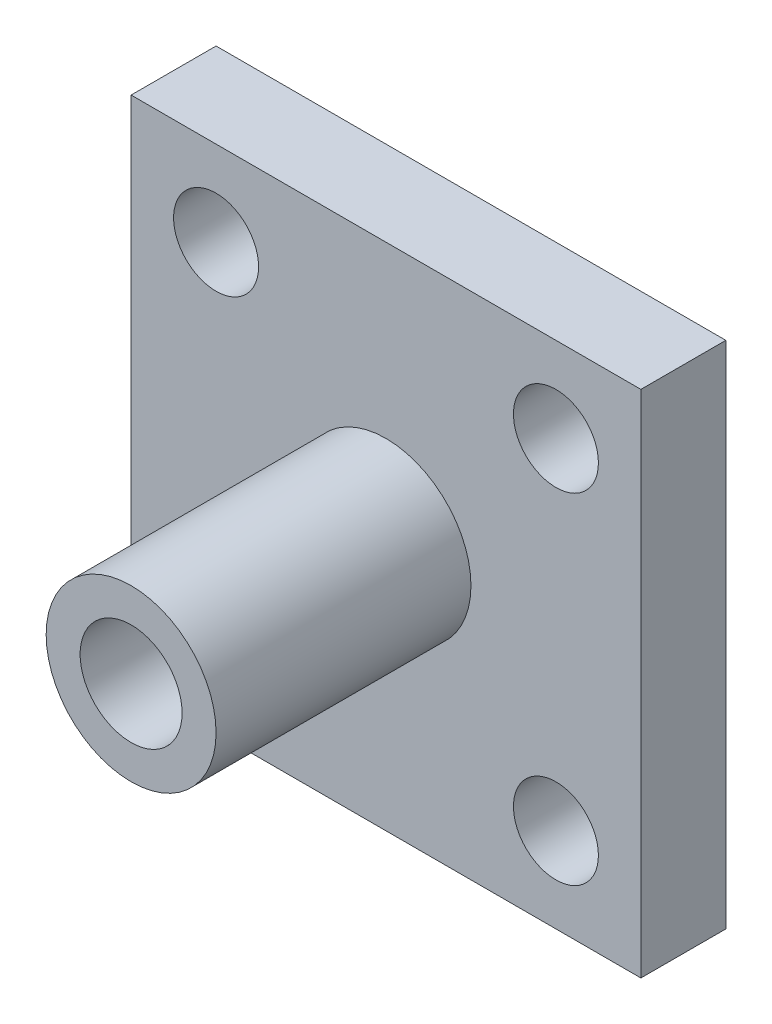
ISO-10303-21;
HEADER;
FILE_DESCRIPTION(('STEP AP214'),'2;1');
FILE_NAME('part.step','',(''),(''),'','','');
FILE_SCHEMA(('AUTOMOTIVE_DESIGN { 1 0 10303 214 1 1 1 1 }'));
ENDSEC;
DATA;
#1=APPLICATION_CONTEXT('core data for automotive mechanical design processes');
#2=APPLICATION_PROTOCOL_DEFINITION('international standard','automotive_design',2000,#1);
#3=PRODUCT_CONTEXT('',#1,'mechanical');
#4=PRODUCT('Part','Part','',(#3));
#5=PRODUCT_RELATED_PRODUCT_CATEGORY('part','',(#4));
#6=PRODUCT_DEFINITION_FORMATION('','',#4);
#7=PRODUCT_DEFINITION_CONTEXT('part definition',#1,'design');
#8=PRODUCT_DEFINITION('design','',#6,#7);
#9=PRODUCT_DEFINITION_SHAPE('','',#8);
#10=(LENGTH_UNIT() NAMED_UNIT(*) SI_UNIT(.MILLI.,.METRE.));
#11=(NAMED_UNIT(*) PLANE_ANGLE_UNIT() SI_UNIT($,.RADIAN.));
#12=(NAMED_UNIT(*) SI_UNIT($,.STERADIAN.) SOLID_ANGLE_UNIT());
#13=UNCERTAINTY_MEASURE_WITH_UNIT(LENGTH_MEASURE(1.E-05),#10,'distance_accuracy_value','');
#14=(GEOMETRIC_REPRESENTATION_CONTEXT(3) GLOBAL_UNCERTAINTY_ASSIGNED_CONTEXT((#13)) GLOBAL_UNIT_ASSIGNED_CONTEXT((#10,
#11,#12)) REPRESENTATION_CONTEXT('',''));
#15=CARTESIAN_POINT('',(0.,0.,0.));
#16=DIRECTION('',(0.,0.,1.));
#17=DIRECTION('',(1.,0.,0.));
#18=AXIS2_PLACEMENT_3D('',#15,#16,#17);
#19=CARTESIAN_POINT('',(0.,0.,5.));
#20=DIRECTION('',(0.,0.,-1.));
#21=DIRECTION('',(-1.,0.,0.));
#22=AXIS2_PLACEMENT_3D('',#19,#20,#21);
#23=PLANE('',#22);
#24=CARTESIAN_POINT('',(0.,0.,5.));
#25=DIRECTION('',(0.,0.,-1.));
#26=DIRECTION('',(-1.,0.,0.));
#27=AXIS2_PLACEMENT_3D('',#24,#25,#26);
#28=CIRCLE('',#27,5.);
#29=CARTESIAN_POINT('',(-5.,0.,5.));
#30=VERTEX_POINT('',#29);
#31=EDGE_CURVE('E11',#30,#30,#28,.F.);
#32=ORIENTED_EDGE('',*,*,#31,.F.);
#33=EDGE_LOOP('',(#32));
#34=FACE_BOUND('',#33,.T.);
#35=DIRECTION('',(0.,1.,0.));
#36=VECTOR('',#35,1.);
#37=CARTESIAN_POINT('',(15.,-15.,5.));
#38=LINE('',#37,#36);
#39=CARTESIAN_POINT('',(15.,-15.,5.));
#40=VERTEX_POINT('',#39);
#41=CARTESIAN_POINT('',(15.,15.,5.));
#42=VERTEX_POINT('',#41);
#43=EDGE_CURVE('E91',#40,#42,#38,.T.);
#44=ORIENTED_EDGE('',*,*,#43,.T.);
#45=DIRECTION('',(-1.,0.,0.));
#46=VECTOR('',#45,1.);
#47=CARTESIAN_POINT('',(-15.,15.,5.));
#48=LINE('',#47,#46);
#49=CARTESIAN_POINT('',(-15.,15.,5.));
#50=VERTEX_POINT('',#49);
#51=EDGE_CURVE('E86',#42,#50,#48,.T.);
#52=ORIENTED_EDGE('',*,*,#51,.T.);
#53=DIRECTION('',(0.,-1.,0.));
#54=VECTOR('',#53,1.);
#55=CARTESIAN_POINT('',(-15.,-15.,5.));
#56=LINE('',#55,#54);
#57=CARTESIAN_POINT('',(-15.,-15.,5.));
#58=VERTEX_POINT('',#57);
#59=EDGE_CURVE('E89',#50,#58,#56,.T.);
#60=ORIENTED_EDGE('',*,*,#59,.T.);
#61=DIRECTION('',(1.,0.,0.));
#62=VECTOR('',#61,1.);
#63=CARTESIAN_POINT('',(-15.,-15.,5.));
#64=LINE('',#63,#62);
#65=EDGE_CURVE('E55',#58,#40,#64,.T.);
#66=ORIENTED_EDGE('',*,*,#65,.T.);
#67=EDGE_LOOP('',(#44,#52,#60,#66));
#68=FACE_BOUND('',#67,.T.);
#69=CARTESIAN_POINT('',(-10.,10.,5.));
#70=DIRECTION('',(0.,0.,1.));
#71=DIRECTION('',(1.,0.,0.));
#72=AXIS2_PLACEMENT_3D('',#69,#70,#71);
#73=CIRCLE('',#72,2.5);
#74=CARTESIAN_POINT('',(-7.5,10.,5.));
#75=VERTEX_POINT('',#74);
#76=EDGE_CURVE('E108',#75,#75,#73,.T.);
#77=ORIENTED_EDGE('',*,*,#76,.F.);
#78=EDGE_LOOP('',(#77));
#79=FACE_BOUND('',#78,.T.);
#80=CARTESIAN_POINT('',(10.,10.,5.));
#81=DIRECTION('',(0.,0.,1.));
#82=DIRECTION('',(1.,0.,0.));
#83=AXIS2_PLACEMENT_3D('',#80,#81,#82);
#84=CIRCLE('',#83,2.5);
#85=CARTESIAN_POINT('',(12.5,10.,5.));
#86=VERTEX_POINT('',#85);
#87=EDGE_CURVE('E211',#86,#86,#84,.T.);
#88=ORIENTED_EDGE('',*,*,#87,.F.);
#89=EDGE_LOOP('',(#88));
#90=FACE_BOUND('',#89,.T.);
#91=CARTESIAN_POINT('',(10.,-10.,5.));
#92=DIRECTION('',(0.,0.,1.));
#93=DIRECTION('',(1.,0.,0.));
#94=AXIS2_PLACEMENT_3D('',#91,#92,#93);
#95=CIRCLE('',#94,2.5);
#96=CARTESIAN_POINT('',(12.5,-10.,5.));
#97=VERTEX_POINT('',#96);
#98=EDGE_CURVE('E206',#97,#97,#95,.T.);
#99=ORIENTED_EDGE('',*,*,#98,.F.);
#100=EDGE_LOOP('',(#99));
#101=FACE_BOUND('',#100,.T.);
#102=CARTESIAN_POINT('',(-10.,-10.,5.));
#103=DIRECTION('',(0.,0.,1.));
#104=DIRECTION('',(1.,0.,0.));
#105=AXIS2_PLACEMENT_3D('',#102,#103,#104);
#106=CIRCLE('',#105,2.5);
#107=CARTESIAN_POINT('',(-7.5,-10.,5.));
#108=VERTEX_POINT('',#107);
#109=EDGE_CURVE('E197',#108,#108,#106,.T.);
#110=ORIENTED_EDGE('',*,*,#109,.F.);
#111=EDGE_LOOP('',(#110));
#112=FACE_BOUND('',#111,.T.);
#113=ADVANCED_FACE('F32',(#34,#68,#79,#90,#101,#112),#23,.F.);
#114=CARTESIAN_POINT('',(0.,0.,0.));
#115=DIRECTION('',(0.,0.,-1.));
#116=DIRECTION('',(-1.,0.,0.));
#117=AXIS2_PLACEMENT_3D('',#114,#115,#116);
#118=PLANE('',#117);
#119=CARTESIAN_POINT('',(10.,-10.,0.));
#120=DIRECTION('',(0.,0.,1.));
#121=DIRECTION('',(1.,0.,0.));
#122=AXIS2_PLACEMENT_3D('',#119,#120,#121);
#123=CIRCLE('',#122,2.5);
#124=CARTESIAN_POINT('',(12.5,-10.,0.));
#125=VERTEX_POINT('',#124);
#126=EDGE_CURVE('E201',#125,#125,#123,.T.);
#127=ORIENTED_EDGE('',*,*,#126,.T.);
#128=EDGE_LOOP('',(#127));
#129=FACE_BOUND('',#128,.T.);
#130=CARTESIAN_POINT('',(-10.,10.,0.));
#131=DIRECTION('',(0.,0.,1.));
#132=DIRECTION('',(1.,0.,0.));
#133=AXIS2_PLACEMENT_3D('',#130,#131,#132);
#134=CIRCLE('',#133,2.5);
#135=CARTESIAN_POINT('',(-7.5,10.,0.));
#136=VERTEX_POINT('',#135);
#137=EDGE_CURVE('E214',#136,#136,#134,.T.);
#138=ORIENTED_EDGE('',*,*,#137,.T.);
#139=EDGE_LOOP('',(#138));
#140=FACE_BOUND('',#139,.T.);
#141=DIRECTION('',(0.,1.,0.));
#142=VECTOR('',#141,1.);
#143=CARTESIAN_POINT('',(15.,-15.,0.));
#144=LINE('',#143,#142);
#145=CARTESIAN_POINT('',(15.,-15.,0.));
#146=VERTEX_POINT('',#145);
#147=CARTESIAN_POINT('',(15.,15.,0.));
#148=VERTEX_POINT('',#147);
#149=EDGE_CURVE('E105',#146,#148,#144,.T.);
#150=ORIENTED_EDGE('',*,*,#149,.F.);
#151=DIRECTION('',(1.,0.,0.));
#152=VECTOR('',#151,1.);
#153=CARTESIAN_POINT('',(-15.,-15.,0.));
#154=LINE('',#153,#152);
#155=CARTESIAN_POINT('',(-15.,-15.,0.));
#156=VERTEX_POINT('',#155);
#157=EDGE_CURVE('E78',#156,#146,#154,.T.);
#158=ORIENTED_EDGE('',*,*,#157,.F.);
#159=DIRECTION('',(0.,-1.,0.));
#160=VECTOR('',#159,1.);
#161=CARTESIAN_POINT('',(-15.,-15.,0.));
#162=LINE('',#161,#160);
#163=CARTESIAN_POINT('',(-15.,15.,0.));
#164=VERTEX_POINT('',#163);
#165=EDGE_CURVE('E72',#164,#156,#162,.T.);
#166=ORIENTED_EDGE('',*,*,#165,.F.);
#167=DIRECTION('',(-1.,0.,0.));
#168=VECTOR('',#167,1.);
#169=CARTESIAN_POINT('',(-15.,15.,0.));
#170=LINE('',#169,#168);
#171=EDGE_CURVE('E96',#148,#164,#170,.T.);
#172=ORIENTED_EDGE('',*,*,#171,.F.);
#173=EDGE_LOOP('',(#150,#158,#166,#172));
#174=FACE_BOUND('',#173,.T.);
#175=CARTESIAN_POINT('',(10.,10.,0.));
#176=DIRECTION('',(0.,0.,1.));
#177=DIRECTION('',(1.,0.,0.));
#178=AXIS2_PLACEMENT_3D('',#175,#176,#177);
#179=CIRCLE('',#178,2.5);
#180=CARTESIAN_POINT('',(12.5,10.,0.));
#181=VERTEX_POINT('',#180);
#182=EDGE_CURVE('E192',#181,#181,#179,.T.);
#183=ORIENTED_EDGE('',*,*,#182,.T.);
#184=EDGE_LOOP('',(#183));
#185=FACE_BOUND('',#184,.T.);
#186=CARTESIAN_POINT('',(-10.,-10.,0.));
#187=DIRECTION('',(0.,0.,1.));
#188=DIRECTION('',(1.,0.,0.));
#189=AXIS2_PLACEMENT_3D('',#186,#187,#188);
#190=CIRCLE('',#189,2.5);
#191=CARTESIAN_POINT('',(-7.5,-10.,0.));
#192=VERTEX_POINT('',#191);
#193=EDGE_CURVE('E195',#192,#192,#190,.T.);
#194=ORIENTED_EDGE('',*,*,#193,.T.);
#195=EDGE_LOOP('',(#194));
#196=FACE_BOUND('',#195,.T.);
#197=ADVANCED_FACE('F171',(#129,#140,#174,#185,#196),#118,.T.);
#198=CARTESIAN_POINT('',(15.,-15.,5.));
#199=DIRECTION('',(-1.,0.,0.));
#200=DIRECTION('',(0.,0.,1.));
#201=AXIS2_PLACEMENT_3D('',#198,#199,#200);
#202=PLANE('',#201);
#203=ORIENTED_EDGE('',*,*,#149,.T.);
#204=DIRECTION('',(0.,0.,-1.));
#205=VECTOR('',#204,1.);
#206=CARTESIAN_POINT('',(15.,15.,5.));
#207=LINE('',#206,#205);
#208=EDGE_CURVE('E46',#42,#148,#207,.T.);
#209=ORIENTED_EDGE('',*,*,#208,.F.);
#210=ORIENTED_EDGE('',*,*,#43,.F.);
#211=DIRECTION('',(0.,0.,-1.));
#212=VECTOR('',#211,1.);
#213=CARTESIAN_POINT('',(15.,-15.,5.));
#214=LINE('',#213,#212);
#215=EDGE_CURVE('E101',#40,#146,#214,.T.);
#216=ORIENTED_EDGE('',*,*,#215,.T.);
#217=EDGE_LOOP('',(#203,#209,#210,#216));
#218=FACE_BOUND('',#217,.T.);
#219=ADVANCED_FACE('F34',(#218),#202,.F.);
#220=CARTESIAN_POINT('',(-15.,15.,5.));
#221=DIRECTION('',(0.,-1.,0.));
#222=DIRECTION('',(0.,0.,-1.));
#223=AXIS2_PLACEMENT_3D('',#220,#221,#222);
#224=PLANE('',#223);
#225=ORIENTED_EDGE('',*,*,#171,.T.);
#226=DIRECTION('',(0.,0.,-1.));
#227=VECTOR('',#226,1.);
#228=CARTESIAN_POINT('',(-15.,15.,5.));
#229=LINE('',#228,#227);
#230=EDGE_CURVE('E94',#50,#164,#229,.T.);
#231=ORIENTED_EDGE('',*,*,#230,.F.);
#232=ORIENTED_EDGE('',*,*,#51,.F.);
#233=ORIENTED_EDGE('',*,*,#208,.T.);
#234=EDGE_LOOP('',(#225,#231,#232,#233));
#235=FACE_BOUND('',#234,.T.);
#236=ADVANCED_FACE('F95',(#235),#224,.F.);
#237=CARTESIAN_POINT('',(-15.,-15.,5.));
#238=DIRECTION('',(1.,0.,0.));
#239=DIRECTION('',(0.,0.,-1.));
#240=AXIS2_PLACEMENT_3D('',#237,#238,#239);
#241=PLANE('',#240);
#242=ORIENTED_EDGE('',*,*,#165,.T.);
#243=DIRECTION('',(0.,0.,-1.));
#244=VECTOR('',#243,1.);
#245=CARTESIAN_POINT('',(-15.,-15.,5.));
#246=LINE('',#245,#244);
#247=EDGE_CURVE('E97',#58,#156,#246,.T.);
#248=ORIENTED_EDGE('',*,*,#247,.F.);
#249=ORIENTED_EDGE('',*,*,#59,.F.);
#250=ORIENTED_EDGE('',*,*,#230,.T.);
#251=EDGE_LOOP('',(#242,#248,#249,#250));
#252=FACE_BOUND('',#251,.T.);
#253=ADVANCED_FACE('F99',(#252),#241,.F.);
#254=CARTESIAN_POINT('',(-15.,-15.,5.));
#255=DIRECTION('',(0.,1.,0.));
#256=DIRECTION('',(0.,0.,1.));
#257=AXIS2_PLACEMENT_3D('',#254,#255,#256);
#258=PLANE('',#257);
#259=ORIENTED_EDGE('',*,*,#157,.T.);
#260=ORIENTED_EDGE('',*,*,#215,.F.);
#261=ORIENTED_EDGE('',*,*,#65,.F.);
#262=ORIENTED_EDGE('',*,*,#247,.T.);
#263=EDGE_LOOP('',(#259,#260,#261,#262));
#264=FACE_BOUND('',#263,.T.);
#265=ADVANCED_FACE('F167',(#264),#258,.F.);
#266=CARTESIAN_POINT('',(-10.,10.,5.));
#267=DIRECTION('',(0.,0.,-1.));
#268=DIRECTION('',(-1.,0.,0.));
#269=AXIS2_PLACEMENT_3D('',#266,#267,#268);
#270=CYLINDRICAL_SURFACE('',#269,2.5);
#271=ORIENTED_EDGE('',*,*,#76,.T.);
#272=EDGE_LOOP('',(#271));
#273=FACE_BOUND('',#272,.T.);
#274=ORIENTED_EDGE('',*,*,#137,.F.);
#275=EDGE_LOOP('',(#274));
#276=FACE_BOUND('',#275,.T.);
#277=ADVANCED_FACE('F163',(#273,#276),#270,.F.);
#278=CARTESIAN_POINT('',(10.,10.,5.));
#279=DIRECTION('',(0.,0.,-1.));
#280=DIRECTION('',(-1.,0.,0.));
#281=AXIS2_PLACEMENT_3D('',#278,#279,#280);
#282=CYLINDRICAL_SURFACE('',#281,2.5);
#283=ORIENTED_EDGE('',*,*,#87,.T.);
#284=EDGE_LOOP('',(#283));
#285=FACE_BOUND('',#284,.T.);
#286=ORIENTED_EDGE('',*,*,#182,.F.);
#287=EDGE_LOOP('',(#286));
#288=FACE_BOUND('',#287,.T.);
#289=ADVANCED_FACE('F159',(#285,#288),#282,.F.);
#290=CARTESIAN_POINT('',(10.,-10.,5.));
#291=DIRECTION('',(0.,0.,-1.));
#292=DIRECTION('',(-1.,0.,0.));
#293=AXIS2_PLACEMENT_3D('',#290,#291,#292);
#294=CYLINDRICAL_SURFACE('',#293,2.5);
#295=ORIENTED_EDGE('',*,*,#98,.T.);
#296=EDGE_LOOP('',(#295));
#297=FACE_BOUND('',#296,.T.);
#298=ORIENTED_EDGE('',*,*,#126,.F.);
#299=EDGE_LOOP('',(#298));
#300=FACE_BOUND('',#299,.T.);
#301=ADVANCED_FACE('F155',(#297,#300),#294,.F.);
#302=CARTESIAN_POINT('',(-10.,-10.,5.));
#303=DIRECTION('',(0.,0.,-1.));
#304=DIRECTION('',(-1.,0.,0.));
#305=AXIS2_PLACEMENT_3D('',#302,#303,#304);
#306=CYLINDRICAL_SURFACE('',#305,2.5);
#307=ORIENTED_EDGE('',*,*,#109,.T.);
#308=EDGE_LOOP('',(#307));
#309=FACE_BOUND('',#308,.T.);
#310=ORIENTED_EDGE('',*,*,#193,.F.);
#311=EDGE_LOOP('',(#310));
#312=FACE_BOUND('',#311,.T.);
#313=ADVANCED_FACE('F150',(#309,#312),#306,.F.);
#314=CARTESIAN_POINT('',(0.,0.,20.));
#315=DIRECTION('',(0.,0.,-1.));
#316=DIRECTION('',(-1.,0.,0.));
#317=AXIS2_PLACEMENT_3D('',#314,#315,#316);
#318=CYLINDRICAL_SURFACE('',#317,5.);
#319=CARTESIAN_POINT('',(-5.,0.,16.));
#320=CARTESIAN_POINT('',(-4.99999271227085,-0.107493005442891,15.9999901481763));
#321=CARTESIAN_POINT('',(-4.99649294306932,-0.215172564090673,15.9912822479116));
#322=CARTESIAN_POINT('',(-4.98283453100641,-0.427496480417895,15.9567522964788));
#323=CARTESIAN_POINT('',(-4.97265778698877,-0.532131777561248,15.9308837209139));
#324=CARTESIAN_POINT('',(-4.94674209213118,-0.734953922727402,15.8631239219412));
#325=CARTESIAN_POINT('',(-4.93102136364072,-0.833160661616957,15.8212851537833));
#326=CARTESIAN_POINT('',(-4.89556610796078,-1.02107197032837,15.7229808266735));
#327=CARTESIAN_POINT('',(-4.87583297458057,-1.11077947675099,15.6665203450811));
#328=CARTESIAN_POINT('',(-4.83330886170419,-1.28350100757039,15.5377645014391));
#329=CARTESIAN_POINT('',(-4.81042296929191,-1.36606227255021,15.4648933437597));
#330=CARTESIAN_POINT('',(-4.76460576906195,-1.51817500478472,15.3065999965232));
#331=CARTESIAN_POINT('',(-4.74167444453792,-1.58772010713353,15.2211717027883));
#332=CARTESIAN_POINT('',(-4.69722791797136,-1.71487456729288,15.0355719297577));
#333=CARTESIAN_POINT('',(-4.67582115964951,-1.77181498119547,14.9349135139768));
#334=CARTESIAN_POINT('',(-4.63833647186793,-1.86775471903715,14.72446360158));
#335=CARTESIAN_POINT('',(-4.62225601244176,-1.90676256428583,14.6146764721516));
#336=CARTESIAN_POINT('',(-4.59826357660819,-1.96389882339587,14.3942876664079));
#337=CARTESIAN_POINT('',(-4.59001420355605,-1.98289396580565,14.2839487644238));
#338=CARTESIAN_POINT('',(-4.58164004049144,-2.00217296164003,14.0613650016927));
#339=CARTESIAN_POINT('',(-4.58151125522768,-2.00246601631322,13.949121105375));
#340=CARTESIAN_POINT('',(-4.58910500279994,-1.98498936750454,13.734243328542));
#341=CARTESIAN_POINT('',(-4.5962817503845,-1.96847531430514,13.631484285591));
#342=CARTESIAN_POINT('',(-4.61676187607836,-1.91994688029782,13.4303404439933));
#343=CARTESIAN_POINT('',(-4.63006632321673,-1.88792979480463,13.3319564118897));
#344=CARTESIAN_POINT('',(-4.6615948508853,-1.80869473255107,13.139982163804));
#345=CARTESIAN_POINT('',(-4.67991379280788,-1.76117986231532,13.0465307609453));
#346=CARTESIAN_POINT('',(-4.7193811638989,-1.65250646073221,12.8685841836384));
#347=CARTESIAN_POINT('',(-4.74053065456849,-1.59134280510084,12.7840923905972));
#348=CARTESIAN_POINT('',(-4.78526736742271,-1.45155059945443,12.619590271198));
#349=CARTESIAN_POINT('',(-4.80891664976152,-1.37193746297064,12.540431270554));
#350=CARTESIAN_POINT('',(-4.85459824958282,-1.20031442743019,12.396315521998));
#351=CARTESIAN_POINT('',(-4.87663024445325,-1.10830206533443,12.3313616025897));
#352=CARTESIAN_POINT('',(-4.91714681264548,-0.912077652605842,12.2163825525842));
#353=CARTESIAN_POINT('',(-4.93555270095415,-0.807660491346477,12.1666777188029));
#354=CARTESIAN_POINT('',(-4.96614828328759,-0.591023765482883,12.0858321389219));
#355=CARTESIAN_POINT('',(-4.97834113462382,-0.478808196849675,12.0546819624426));
#356=CARTESIAN_POINT('',(-4.99456139506911,-0.256895887607822,12.0135517045803));
#357=CARTESIAN_POINT('',(-4.99902945833514,-0.147443293985536,12.0024275457464));
#358=CARTESIAN_POINT('',(-5.00068478510631,0.0718453098078153,11.9982868994714));
#359=CARTESIAN_POINT('',(-4.99787393582291,0.181681213223922,12.0052657184525));
#360=CARTESIAN_POINT('',(-4.98557567063753,0.393432739121986,12.036291752552));
#361=CARTESIAN_POINT('',(-4.97639391345523,0.495482491775473,12.059557980351));
#362=CARTESIAN_POINT('',(-4.952594414055,0.694135428060779,12.1214357083098));
#363=CARTESIAN_POINT('',(-4.9379759735653,0.790737910224843,12.1600491796687));
#364=CARTESIAN_POINT('',(-4.90416594770812,0.979078785816701,12.2527849396799));
#365=CARTESIAN_POINT('',(-4.88484815979804,1.0705780227554,12.3073454720431));
#366=CARTESIAN_POINT('',(-4.84373364745525,1.24344359124655,12.4299403239056));
#367=CARTESIAN_POINT('',(-4.82193593110271,1.32480584076112,12.4979800429226));
#368=CARTESIAN_POINT('',(-4.77645117638112,1.48072304302882,12.6508700129496));
#369=CARTESIAN_POINT('',(-4.75273441425052,1.55447393380606,12.7365335415062));
#370=CARTESIAN_POINT('',(-4.70741672917132,1.68675119741371,12.9194400830094));
#371=CARTESIAN_POINT('',(-4.68581615526511,1.74527506133751,13.0166850003399));
#372=CARTESIAN_POINT('',(-4.64714299907708,1.84580750193163,13.2214616945941));
#373=CARTESIAN_POINT('',(-4.63011630884788,1.88765059453445,13.3290839992123));
#374=CARTESIAN_POINT('',(-4.60323673477931,1.9522962197053,13.5507336517152));
#375=CARTESIAN_POINT('',(-4.59337855695998,1.97511280526931,13.6647562058124));
#376=CARTESIAN_POINT('',(-4.58271759299926,1.9997156172784,13.8871279017745));
#377=CARTESIAN_POINT('',(-4.58131421008171,2.00289708230287,13.9952948395933));
#378=CARTESIAN_POINT('',(-4.58614836033098,1.99180315927752,14.2105448577133));
#379=CARTESIAN_POINT('',(-4.59238492324793,1.97752998791378,14.3176280739026));
#380=CARTESIAN_POINT('',(-4.61126649079021,1.93307136615365,14.523332189855));
#381=CARTESIAN_POINT('',(-4.62364831827449,1.90353749357098,14.622120274433));
#382=CARTESIAN_POINT('',(-4.65324001232696,1.83000544849101,14.8133786296135));
#383=CARTESIAN_POINT('',(-4.67045121206007,1.78600328139381,14.9058471468998));
#384=CARTESIAN_POINT('',(-4.70898609604491,1.68187276275973,15.0876096192708));
#385=CARTESIAN_POINT('',(-4.73048882313242,1.62096533515949,15.1764186701305));
#386=CARTESIAN_POINT('',(-4.77463804372237,1.4858921192715,15.3429933172038));
#387=CARTESIAN_POINT('',(-4.79728488048406,1.41172233481812,15.4207555721283));
#388=CARTESIAN_POINT('',(-4.84293567087394,1.24650550627246,15.5682028532636));
#389=CARTESIAN_POINT('',(-4.86586757962185,1.15467600114614,15.6370373068981));
#390=CARTESIAN_POINT('',(-4.90800406713717,0.959900320285781,15.7583370426216));
#391=CARTESIAN_POINT('',(-4.92720691092906,0.856949004547239,15.8107947121525));
#392=CARTESIAN_POINT('',(-4.95939714815861,0.644738062495203,15.8966222151903));
#393=CARTESIAN_POINT('',(-4.97249363055028,0.535631618219696,15.9303293235603));
#394=CARTESIAN_POINT('',(-4.99144306209366,0.31287654628122,15.9786391209543));
#395=CARTESIAN_POINT('',(-4.99731899495638,0.199243525858912,15.9933024367439));
#396=CARTESIAN_POINT('',(-4.99975899504136,0.0569122978909296,15.9993953809783));
#397=CARTESIAN_POINT('',(-5.00000192969176,0.0284626887407584,16.0000026086292));
#398=CARTESIAN_POINT('',(-5.,0.,16.));
#399=B_SPLINE_CURVE_WITH_KNOTS('',3,(#319,#320,#321,#322,#323,#324,#325,#326,#327,#328,#329,
#330,#331,#332,#333,#334,#335,#336,#337,#338,#339,#340,#341,#342,#343,#344,#345,#346,#347,#348,
#349,#350,#351,#352,#353,#354,#355,#356,#357,#358,#359,#360,#361,#362,#363,#364,#365,#366,#367,
#368,#369,#370,#371,#372,#373,#374,#375,#376,#377,#378,#379,#380,#381,#382,#383,#384,#385,#386,
#387,#388,#389,#390,#391,#392,#393,#394,#395,#396,#397,#398),.UNSPECIFIED.,.T.,.F.,(4,2,2,2,2,2,
2,2,2,2,2,2,2,2,2,2,2,2,2,2,2,2,2,2,2,2,2,2,2,2,2,2,2,2,2,2,2,2,2,4),(0.,0.32240298789307,
0.645683636007934,0.967911457471579,1.29002753567984,1.62597381700397,1.96208394934411,
2.31315258819217,2.66405423118268,2.99904105308828,3.33386306340488,3.64538328401372,
3.95695787256047,4.27489126298816,4.59294421938183,4.93558349186557,5.27829092839732,
5.62776913162806,5.9770695611379,6.30569184528007,6.63422893570082,6.94800455564365,
7.26182048993796,7.58523513398262,7.90877959498968,8.25368474624413,8.59864669043747,
8.94695045140827,9.29499672645933,9.61799673392748,9.94095572563045,10.2511431854877,
10.5614163580516,10.8894546805669,11.2175920134839,11.5670042353384,11.9165786364053,
12.2596430101332,12.6016125240434,12.686980458968),.UNSPECIFIED.);
#400=CARTESIAN_POINT('',(-5.,0.,16.));
#401=VERTEX_POINT('',#400);
#402=EDGE_CURVE('E120',#401,#401,#399,.T.);
#403=ORIENTED_EDGE('',*,*,#402,.T.);
#404=EDGE_LOOP('',(#403));
#405=FACE_BOUND('',#404,.T.);
#406=CARTESIAN_POINT('',(-5.,0.,10.));
#407=CARTESIAN_POINT('',(-4.99999271227085,-0.107493005442891,9.99999014817627));
#408=CARTESIAN_POINT('',(-4.99649294306932,-0.215172564090673,9.99128224791162));
#409=CARTESIAN_POINT('',(-4.98283453100641,-0.427496480417896,9.95675229647876));
#410=CARTESIAN_POINT('',(-4.97265778698877,-0.532131777561248,9.93088372091387));
#411=CARTESIAN_POINT('',(-4.94674209213118,-0.734953922727403,9.86312392194117));
#412=CARTESIAN_POINT('',(-4.93102136364072,-0.833160661616958,9.82128515378327));
#413=CARTESIAN_POINT('',(-4.89556610796078,-1.02107197032837,9.72298082667345));
#414=CARTESIAN_POINT('',(-4.87583297458057,-1.11077947675099,9.66652034508107));
#415=CARTESIAN_POINT('',(-4.83330886170419,-1.28350100757039,9.53776450143906));
#416=CARTESIAN_POINT('',(-4.81042296929191,-1.36606227255021,9.46489334375974));
#417=CARTESIAN_POINT('',(-4.76460576906195,-1.51817500478472,9.30659999652322));
#418=CARTESIAN_POINT('',(-4.74167444453792,-1.58772010713353,9.22117170278826));
#419=CARTESIAN_POINT('',(-4.69722791797136,-1.71487456729288,9.03557192975773));
#420=CARTESIAN_POINT('',(-4.67582115964951,-1.77181498119547,8.9349135139768));
#421=CARTESIAN_POINT('',(-4.63833647186793,-1.86775471903715,8.72446360157996));
#422=CARTESIAN_POINT('',(-4.62225601244176,-1.90676256428583,8.61467647215164));
#423=CARTESIAN_POINT('',(-4.59826357660818,-1.96389882339587,8.3942876664079));
#424=CARTESIAN_POINT('',(-4.59001420355605,-1.98289396580565,8.28394876442379));
#425=CARTESIAN_POINT('',(-4.58164004049144,-2.00217296164003,8.06136500169273));
#426=CARTESIAN_POINT('',(-4.58151125522768,-2.00246601631322,7.94912110537499));
#427=CARTESIAN_POINT('',(-4.58910500279994,-1.98498936750454,7.73424332854196));
#428=CARTESIAN_POINT('',(-4.5962817503845,-1.96847531430514,7.63148428559097));
#429=CARTESIAN_POINT('',(-4.61676187607836,-1.91994688029782,7.43034044399329));
#430=CARTESIAN_POINT('',(-4.63006632321673,-1.88792979480463,7.33195641188969));
#431=CARTESIAN_POINT('',(-4.6615948508853,-1.80869473255107,7.13998216380396));
#432=CARTESIAN_POINT('',(-4.67991379280788,-1.76117986231532,7.04653076094531));
#433=CARTESIAN_POINT('',(-4.7193811638989,-1.65250646073221,6.86858418363844));
#434=CARTESIAN_POINT('',(-4.74053065456848,-1.59134280510084,6.78409239059719));
#435=CARTESIAN_POINT('',(-4.78526736742271,-1.45155059945443,6.619590271198));
#436=CARTESIAN_POINT('',(-4.80891664976152,-1.37193746297064,6.54043127055398));
#437=CARTESIAN_POINT('',(-4.85459824958282,-1.20031442743019,6.39631552199796));
#438=CARTESIAN_POINT('',(-4.87663024445325,-1.10830206533443,6.33136160258971));
#439=CARTESIAN_POINT('',(-4.91714681264548,-0.912077652605843,6.21638255258417));
#440=CARTESIAN_POINT('',(-4.93555270095415,-0.807660491346478,6.16667771880295));
#441=CARTESIAN_POINT('',(-4.96614828328759,-0.591023765482883,6.08583213892194));
#442=CARTESIAN_POINT('',(-4.97834113462382,-0.478808196849675,6.05468196244259));
#443=CARTESIAN_POINT('',(-4.99456139506911,-0.256895887607821,6.0135517045803));
#444=CARTESIAN_POINT('',(-4.99902945833514,-0.147443293985536,6.00242754574644));
#445=CARTESIAN_POINT('',(-5.00068478510631,0.0718453098078162,5.99828689947139));
#446=CARTESIAN_POINT('',(-4.99787393582291,0.181681213223923,6.00526571845249));
#447=CARTESIAN_POINT('',(-4.98557567063753,0.393432739121987,6.03629175255199));
#448=CARTESIAN_POINT('',(-4.97639391345523,0.495482491775474,6.05955798035098));
#449=CARTESIAN_POINT('',(-4.952594414055,0.69413542806078,6.12143570830981));
#450=CARTESIAN_POINT('',(-4.9379759735653,0.790737910224844,6.16004917966868));
#451=CARTESIAN_POINT('',(-4.90416594770812,0.979078785816702,6.25278493967995));
#452=CARTESIAN_POINT('',(-4.88484815979804,1.07057802275541,6.30734547204315));
#453=CARTESIAN_POINT('',(-4.84373364745525,1.24344359124656,6.42994032390564));
#454=CARTESIAN_POINT('',(-4.8219359311027,1.32480584076113,6.49798004292261));
#455=CARTESIAN_POINT('',(-4.77645117638112,1.48072304302882,6.65087001294963));
#456=CARTESIAN_POINT('',(-4.75273441425052,1.55447393380606,6.73653354150621));
#457=CARTESIAN_POINT('',(-4.70741672917132,1.68675119741371,6.91944008300937));
#458=CARTESIAN_POINT('',(-4.68581615526511,1.74527506133751,7.01668500033995));
#459=CARTESIAN_POINT('',(-4.64714299907709,1.84580750193163,7.2214616945941));
#460=CARTESIAN_POINT('',(-4.63011630884788,1.88765059453445,7.32908399921231));
#461=CARTESIAN_POINT('',(-4.60323673477932,1.9522962197053,7.55073365171516));
#462=CARTESIAN_POINT('',(-4.59337855695998,1.97511280526932,7.66475620581243));
#463=CARTESIAN_POINT('',(-4.58271759299926,1.9997156172784,7.88712790177454));
#464=CARTESIAN_POINT('',(-4.58131421008171,2.00289708230287,7.99529483959335));
#465=CARTESIAN_POINT('',(-4.58614836033098,1.99180315927752,8.21054485771329));
#466=CARTESIAN_POINT('',(-4.59238492324793,1.97752998791378,8.31762807390258));
#467=CARTESIAN_POINT('',(-4.61126649079021,1.93307136615365,8.52333218985504));
#468=CARTESIAN_POINT('',(-4.62364831827449,1.90353749357098,8.622120274433));
#469=CARTESIAN_POINT('',(-4.65324001232696,1.83000544849101,8.81337862961348));
#470=CARTESIAN_POINT('',(-4.67045121206007,1.78600328139381,8.90584714689982));
#471=CARTESIAN_POINT('',(-4.70898609604491,1.68187276275973,9.08760961927078));
#472=CARTESIAN_POINT('',(-4.73048882313242,1.62096533515949,9.17641867013048));
#473=CARTESIAN_POINT('',(-4.77463804372237,1.4858921192715,9.34299331720375));
#474=CARTESIAN_POINT('',(-4.79728488048406,1.41172233481812,9.42075557212831));
#475=CARTESIAN_POINT('',(-4.84293567087394,1.24650550627246,9.56820285326362));
#476=CARTESIAN_POINT('',(-4.86586757962185,1.15467600114614,9.63703730689807));
#477=CARTESIAN_POINT('',(-4.90800406713717,0.959900320285781,9.75833704262164));
#478=CARTESIAN_POINT('',(-4.92720691092906,0.856949004547239,9.81079471215253));
#479=CARTESIAN_POINT('',(-4.95939714815861,0.644738062495204,9.89662221519029));
#480=CARTESIAN_POINT('',(-4.97249363055028,0.535631618219697,9.93032932356034));
#481=CARTESIAN_POINT('',(-4.99144306209366,0.312876546281221,9.97863912095427));
#482=CARTESIAN_POINT('',(-4.99731899495638,0.199243525858914,9.9933024367439));
#483=CARTESIAN_POINT('',(-4.99975899504136,0.0569122978909304,9.99939538097827));
#484=CARTESIAN_POINT('',(-5.00000192969176,0.0284626887407588,10.0000026086292));
#485=CARTESIAN_POINT('',(-5.,0.,10.));
#486=B_SPLINE_CURVE_WITH_KNOTS('',3,(#406,#407,#408,#409,#410,#411,#412,#413,#414,#415,#416,
#417,#418,#419,#420,#421,#422,#423,#424,#425,#426,#427,#428,#429,#430,#431,#432,#433,#434,#435,
#436,#437,#438,#439,#440,#441,#442,#443,#444,#445,#446,#447,#448,#449,#450,#451,#452,#453,#454,
#455,#456,#457,#458,#459,#460,#461,#462,#463,#464,#465,#466,#467,#468,#469,#470,#471,#472,#473,
#474,#475,#476,#477,#478,#479,#480,#481,#482,#483,#484,#485),.UNSPECIFIED.,.T.,.F.,(4,2,2,2,2,2,
2,2,2,2,2,2,2,2,2,2,2,2,2,2,2,2,2,2,2,2,2,2,2,2,2,2,2,2,2,2,2,2,2,4),(0.,0.322402987893071,
0.645683636007934,0.96791145747158,1.29002753567984,1.62597381700397,1.96208394934411,
2.31315258819217,2.66405423118268,2.99904105308829,3.33386306340488,3.64538328401372,
3.95695787256047,4.27489126298816,4.59294421938183,4.93558349186557,5.27829092839733,
5.62776913162806,5.9770695611379,6.30569184528007,6.63422893570082,6.94800455564366,
7.26182048993797,7.58523513398263,7.90877959498969,8.25368474624414,8.59864669043748,
8.94695045140828,9.29499672645934,9.61799673392748,9.94095572563046,10.2511431854877,
10.5614163580516,10.8894546805669,11.2175920134839,11.5670042353384,11.9165786364053,
12.2596430101332,12.6016125240434,12.686980458968),.UNSPECIFIED.);
#487=CARTESIAN_POINT('',(-5.,0.,10.));
#488=VERTEX_POINT('',#487);
#489=EDGE_CURVE('E119',#488,#488,#486,.T.);
#490=ORIENTED_EDGE('',*,*,#489,.T.);
#491=EDGE_LOOP('',(#490));
#492=FACE_BOUND('',#491,.T.);
#493=CARTESIAN_POINT('',(0.,0.,20.));
#494=DIRECTION('',(0.,0.,1.));
#495=DIRECTION('',(1.,0.,0.));
#496=AXIS2_PLACEMENT_3D('',#493,#494,#495);
#497=CIRCLE('',#496,5.);
#498=CARTESIAN_POINT('',(5.,0.,20.));
#499=VERTEX_POINT('',#498);
#500=EDGE_CURVE('E198',#499,#499,#497,.T.);
#501=ORIENTED_EDGE('',*,*,#500,.F.);
#502=EDGE_LOOP('',(#501));
#503=FACE_BOUND('',#502,.T.);
#504=ORIENTED_EDGE('',*,*,#31,.T.);
#505=EDGE_LOOP('',(#504));
#506=FACE_BOUND('',#505,.T.);
#507=ADVANCED_FACE('F145',(#405,#492,#503,#506),#318,.T.);
#508=CARTESIAN_POINT('',(0.,0.,20.));
#509=DIRECTION('',(0.,0.,1.));
#510=DIRECTION('',(1.,0.,0.));
#511=AXIS2_PLACEMENT_3D('',#508,#509,#510);
#512=PLANE('',#511);
#513=CARTESIAN_POINT('',(0.,0.,20.));
#514=DIRECTION('',(0.,0.,1.));
#515=DIRECTION('',(1.,0.,0.));
#516=AXIS2_PLACEMENT_3D('',#513,#514,#515);
#517=CIRCLE('',#516,3.);
#518=CARTESIAN_POINT('',(3.,0.,20.));
#519=VERTEX_POINT('',#518);
#520=EDGE_CURVE('E140',#519,#519,#517,.T.);
#521=ORIENTED_EDGE('',*,*,#520,.F.);
#522=EDGE_LOOP('',(#521));
#523=FACE_BOUND('',#522,.T.);
#524=ORIENTED_EDGE('',*,*,#500,.T.);
#525=EDGE_LOOP('',(#524));
#526=FACE_BOUND('',#525,.T.);
#527=ADVANCED_FACE('F149',(#523,#526),#512,.T.);
#528=CARTESIAN_POINT('',(0.,0.,5.));
#529=DIRECTION('',(0.,0.,1.));
#530=DIRECTION('',(1.,0.,0.));
#531=AXIS2_PLACEMENT_3D('',#528,#529,#530);
#532=CYLINDRICAL_SURFACE('',#531,3.);
#533=CARTESIAN_POINT('',(-3.,0.,12.));
#534=CARTESIAN_POINT('',(-3.0000004164484,-0.100484716668078,11.9999994503675));
#535=CARTESIAN_POINT('',(-2.99490802753388,-0.200969087132901,12.0076139699555));
#536=CARTESIAN_POINT('',(-2.97504652423809,-0.39873305803168,12.0375968641057));
#537=CARTESIAN_POINT('',(-2.96027281581235,-0.496011113955006,12.0599722431233));
#538=CARTESIAN_POINT('',(-2.92250482404708,-0.684212307854248,12.1181077173248));
#539=CARTESIAN_POINT('',(-2.89954905493315,-0.775162872657554,12.1538051400079));
#540=CARTESIAN_POINT('',(-2.8472613787744,-0.949415290997259,12.2370633632715));
#541=CARTESIAN_POINT('',(-2.8179285460551,-1.03271603160967,12.2846258863006));
#542=CARTESIAN_POINT('',(-2.75227329369838,-1.19728470077011,12.3946569373674));
#543=CARTESIAN_POINT('',(-2.71556897579319,-1.27778030546067,12.4580478607429));
#544=CARTESIAN_POINT('',(-2.63982313083466,-1.42772804469274,12.5957300486584));
#545=CARTESIAN_POINT('',(-2.60077830356832,-1.49716405543888,12.6700369298377));
#546=CARTESIAN_POINT('',(-2.51728264678794,-1.63422297745496,12.8410523676127));
#547=CARTESIAN_POINT('',(-2.47295067937795,-1.6998318636275,12.9394456532035));
#548=CARTESIAN_POINT('',(-2.3908414735282,-1.81350357014174,13.1483633776465));
#549=CARTESIAN_POINT('',(-2.35305295954668,-1.86159673426503,13.2588664015627));
#550=CARTESIAN_POINT('',(-2.29976266641461,-1.92674035011438,13.4567112934216));
#551=CARTESIAN_POINT('',(-2.28097627892403,-1.94874447236008,13.5415284528739));
#552=CARTESIAN_POINT('',(-2.25257969659604,-1.98150617785228,13.7147445047416));
#553=CARTESIAN_POINT('',(-2.24295368744147,-1.99228314651963,13.8031369487261));
#554=CARTESIAN_POINT('',(-2.23436605608045,-2.00191364141227,13.9814747788565));
#555=CARTESIAN_POINT('',(-2.23544802558502,-2.00071842917524,14.0714250234524));
#556=CARTESIAN_POINT('',(-2.24819775483425,-1.98637581333356,14.2496349734998));
#557=CARTESIAN_POINT('',(-2.25987448286881,-1.97321828380393,14.3378931820281));
#558=CARTESIAN_POINT('',(-2.2912718598996,-1.93664994217326,14.5064670512419));
#559=CARTESIAN_POINT('',(-2.31061488324375,-1.91371711479477,14.5869613359388));
#560=CARTESIAN_POINT('',(-2.35509622933623,-1.85870118583424,14.7430236909758));
#561=CARTESIAN_POINT('',(-2.3802364585489,-1.8266150732855,14.8185901302387));
#562=CARTESIAN_POINT('',(-2.43964196377947,-1.74673818732648,14.9790253953564));
#563=CARTESIAN_POINT('',(-2.47472317740626,-1.69708052300445,15.0626599004831));
#564=CARTESIAN_POINT('',(-2.54691537733438,-1.58668960438221,15.2213833952857));
#565=CARTESIAN_POINT('',(-2.58402882709328,-1.52594268999614,15.2964616577621));
#566=CARTESIAN_POINT('',(-2.66543343763724,-1.37981165322308,15.4525425456034));
#567=CARTESIAN_POINT('',(-2.7095474472056,-1.29193938283656,15.5313340486828));
#568=CARTESIAN_POINT('',(-2.79218100665212,-1.10200799908008,15.6731964945385));
#569=CARTESIAN_POINT('',(-2.83070577648042,-0.999962299343694,15.736282145409));
#570=CARTESIAN_POINT('',(-2.89145404090364,-0.804857827096527,15.8334777186229));
#571=CARTESIAN_POINT('',(-2.9153926116554,-0.713957643371907,15.8708433633389));
#572=CARTESIAN_POINT('',(-2.95507719030499,-0.526036043935477,15.9321049256254));
#573=CARTESIAN_POINT('',(-2.97083012127544,-0.429019879001647,15.9560122271322));
#574=CARTESIAN_POINT('',(-2.99275882156808,-0.230985453172278,15.989161165238));
#575=CARTESIAN_POINT('',(-2.99889322461187,-0.129951811934155,15.9983394609383));
#576=CARTESIAN_POINT('',(-3.00083114965147,0.0724415193893494,16.0012470885622));
#577=CARTESIAN_POINT('',(-2.99663539385634,0.173801186186628,15.9949775004888));
#578=CARTESIAN_POINT('',(-2.97899589424273,0.366455717204241,15.968375944438));
#579=CARTESIAN_POINT('',(-2.96622246390226,0.457957444679195,15.9490627022448));
#580=CARTESIAN_POINT('',(-2.93318449284837,0.636116392427403,15.8984043139871));
#581=CARTESIAN_POINT('',(-2.91291875746989,0.722772837571136,15.8670572490718));
#582=CARTESIAN_POINT('',(-2.86496352529158,0.894664750465999,15.7913477029551));
#583=CARTESIAN_POINT('',(-2.83689870135785,0.979496184631421,15.7463118459181));
#584=CARTESIAN_POINT('',(-2.77601855611511,1.14068302395729,15.6455667100537));
#585=CARTESIAN_POINT('',(-2.74320030403941,1.21703314820091,15.5898508394678));
#586=CARTESIAN_POINT('',(-2.6695454665343,1.37185445482324,15.4593921318425));
#587=CARTESIAN_POINT('',(-2.62826156800165,1.44875187569565,15.3830337399249));
#588=CARTESIAN_POINT('',(-2.54571173085958,1.58933968069449,15.2188885700429));
#589=CARTESIAN_POINT('',(-2.50444582417845,1.6530209365723,15.1310939608925));
#590=CARTESIAN_POINT('',(-2.4293967897058,1.76124776549313,14.9528575872319));
#591=CARTESIAN_POINT('',(-2.39527597025701,1.80695636125283,14.8632679665378));
#592=CARTESIAN_POINT('',(-2.33438974266154,1.88496213740264,14.6761273475564));
#593=CARTESIAN_POINT('',(-2.30761112529822,1.91728345682189,14.5785910616954));
#594=CARTESIAN_POINT('',(-2.26933208182633,1.9623584346534,14.3954355128046));
#595=CARTESIAN_POINT('',(-2.25594998021257,1.97758597566225,14.310828190124));
#596=CARTESIAN_POINT('',(-2.23879466438398,1.99699205923373,14.1394267186816));
#597=CARTESIAN_POINT('',(-2.23501101347816,2.00118260285317,14.0526350488605));
#598=CARTESIAN_POINT('',(-2.23764201149982,1.99823921981266,13.8793569432763));
#599=CARTESIAN_POINT('',(-2.24406269907463,1.99109858767783,13.7928707186262));
#600=CARTESIAN_POINT('',(-2.26610452403491,1.96596997224746,13.6226564714679));
#601=CARTESIAN_POINT('',(-2.28173793527615,1.94796751728257,13.5389322861757));
#602=CARTESIAN_POINT('',(-2.32526843904801,1.89593035657494,13.3542888135188));
#603=CARTESIAN_POINT('',(-2.35532333574983,1.85890187130764,13.2547322870567));
#604=CARTESIAN_POINT('',(-2.42222161121309,1.7708452623622,13.0645131656158));
#605=CARTESIAN_POINT('',(-2.459074496867,1.71979748341259,12.9738633020083));
#606=CARTESIAN_POINT('',(-2.53617186577119,1.60398280555152,12.8007181128638));
#607=CARTESIAN_POINT('',(-2.5764658739228,1.5389830989402,12.7184012545769));
#608=CARTESIAN_POINT('',(-2.65628301537844,1.39671768031094,12.5646775217421));
#609=CARTESIAN_POINT('',(-2.69580590832396,1.31944821025748,12.4932740029708));
#610=CARTESIAN_POINT('',(-2.77631551964082,1.14145732976974,12.3532878956909));
#611=CARTESIAN_POINT('',(-2.81669805449991,1.03896166955574,12.2865813598217));
#612=CARTESIAN_POINT('',(-2.88777665874161,0.820868555771209,12.1720867233347));
#613=CARTESIAN_POINT('',(-2.91848793445255,0.705292062449149,12.124268893176));
#614=CARTESIAN_POINT('',(-2.96101644836896,0.491435069835738,12.0588454218362));
#615=CARTESIAN_POINT('',(-2.97551480368935,0.395012325257916,12.0368889609014));
#616=CARTESIAN_POINT('',(-2.99500280141853,0.199058012023943,12.0074719674619));
#617=CARTESIAN_POINT('',(-2.99999958751315,0.0995288361880064,12.000000544404));
#618=CARTESIAN_POINT('',(-3.,0.,12.));
#619=B_SPLINE_CURVE_WITH_KNOTS('',3,(#533,#534,#535,#536,#537,#538,#539,#540,#541,#542,#543,
#544,#545,#546,#547,#548,#549,#550,#551,#552,#553,#554,#555,#556,#557,#558,#559,#560,#561,#562,
#563,#564,#565,#566,#567,#568,#569,#570,#571,#572,#573,#574,#575,#576,#577,#578,#579,#580,#581,
#582,#583,#584,#585,#586,#587,#588,#589,#590,#591,#592,#593,#594,#595,#596,#597,#598,#599,#600,
#601,#602,#603,#604,#605,#606,#607,#608,#609,#610,#611,#612,#613,#614,#615,#616,#617,#618),
.UNSPECIFIED.,.T.,.F.,(4,2,2,2,2,2,2,2,2,2,2,2,2,2,2,2,2,2,2,2,2,2,2,2,2,2,2,2,2,2,2,2,2,2,2,2,
2,2,2,2,2,2,4),(0.,0.301053226505399,0.602249414348688,0.902046153190231,1.20188643867386,
1.52717029000557,1.85292411604318,2.23006683295982,2.60655305445439,2.87433693676029,
3.14165767845809,3.41006711735378,3.67870397263352,3.93548862198022,4.19235783805078,
4.50147574660873,4.81097703780057,5.18718954496752,5.56304840301363,5.86524087696758,
6.16717735142813,6.47040883294251,6.77361911533415,7.05553084792472,7.3374875513827,
7.63652346829516,7.93574454945204,8.28228176141291,8.62905753175758,8.94649935304476,
9.26336626640723,9.52324048016135,9.78283200333091,10.0425772028455,10.302669238524,
10.6320660870419,10.9619271337795,11.2977924520448,11.6337608397015,12.0179535155883,
12.4015390656083,12.6999529136674,12.9981423125957),.UNSPECIFIED.);
#620=CARTESIAN_POINT('',(-3.,0.,12.));
#621=VERTEX_POINT('',#620);
#622=EDGE_CURVE('E36',#621,#621,#619,.T.);
#623=ORIENTED_EDGE('',*,*,#622,.T.);
#624=EDGE_LOOP('',(#623));
#625=FACE_BOUND('',#624,.T.);
#626=CARTESIAN_POINT('',(-3.,0.,6.));
#627=CARTESIAN_POINT('',(-3.0000004164484,-0.100484716668078,5.99999945036753));
#628=CARTESIAN_POINT('',(-2.99490802753388,-0.200969087132901,6.0076139699555));
#629=CARTESIAN_POINT('',(-2.97504652423809,-0.398733058031681,6.03759686410566));
#630=CARTESIAN_POINT('',(-2.96027281581235,-0.496011113955007,6.05997224312329));
#631=CARTESIAN_POINT('',(-2.92250482404708,-0.684212307854249,6.11810771732484));
#632=CARTESIAN_POINT('',(-2.89954905493315,-0.775162872657554,6.15380514000794));
#633=CARTESIAN_POINT('',(-2.8472613787744,-0.94941529099726,6.2370633632715));
#634=CARTESIAN_POINT('',(-2.8179285460551,-1.03271603160967,6.28462588630056));
#635=CARTESIAN_POINT('',(-2.75227329369838,-1.19728470077011,6.39465693736743));
#636=CARTESIAN_POINT('',(-2.71556897579319,-1.27778030546067,6.45804786074289));
#637=CARTESIAN_POINT('',(-2.63982313083466,-1.42772804469274,6.59573004865845));
#638=CARTESIAN_POINT('',(-2.60077830356832,-1.49716405543888,6.67003692983774));
#639=CARTESIAN_POINT('',(-2.51728264678794,-1.63422297745496,6.84105236761267));
#640=CARTESIAN_POINT('',(-2.47295067937795,-1.6998318636275,6.93944565320345));
#641=CARTESIAN_POINT('',(-2.3908414735282,-1.81350357014175,7.14836337764653));
#642=CARTESIAN_POINT('',(-2.35305295954668,-1.86159673426503,7.25886640156274));
#643=CARTESIAN_POINT('',(-2.2997626664146,-1.92674035011438,7.45671129342163));
#644=CARTESIAN_POINT('',(-2.28097627892403,-1.94874447236008,7.54152845287391));
#645=CARTESIAN_POINT('',(-2.25257969659604,-1.98150617785228,7.71474450474165));
#646=CARTESIAN_POINT('',(-2.24295368744147,-1.99228314651963,7.80313694872606));
#647=CARTESIAN_POINT('',(-2.23436605608045,-2.00191364141227,7.98147477885647));
#648=CARTESIAN_POINT('',(-2.23544802558502,-2.00071842917524,8.0714250234524));
#649=CARTESIAN_POINT('',(-2.24819775483425,-1.98637581333356,8.24963497349976));
#650=CARTESIAN_POINT('',(-2.25987448286881,-1.97321828380393,8.33789318202813));
#651=CARTESIAN_POINT('',(-2.29127185989959,-1.93664994217326,8.50646705124188));
#652=CARTESIAN_POINT('',(-2.31061488324375,-1.91371711479477,8.58696133593877));
#653=CARTESIAN_POINT('',(-2.35509622933623,-1.85870118583424,8.74302369097578));
#654=CARTESIAN_POINT('',(-2.3802364585489,-1.8266150732855,8.81859013023865));
#655=CARTESIAN_POINT('',(-2.43964196377947,-1.74673818732648,8.97902539535644));
#656=CARTESIAN_POINT('',(-2.47472317740626,-1.69708052300445,9.0626599004831));
#657=CARTESIAN_POINT('',(-2.54691537733438,-1.58668960438221,9.22138339528575));
#658=CARTESIAN_POINT('',(-2.58402882709328,-1.52594268999614,9.29646165776207));
#659=CARTESIAN_POINT('',(-2.66543343763724,-1.37981165322308,9.45254254560342));
#660=CARTESIAN_POINT('',(-2.7095474472056,-1.29193938283656,9.53133404868277));
#661=CARTESIAN_POINT('',(-2.79218100665212,-1.10200799908008,9.67319649453849));
#662=CARTESIAN_POINT('',(-2.83070577648042,-0.999962299343695,9.73628214540898));
#663=CARTESIAN_POINT('',(-2.89145404090364,-0.804857827096528,9.83347771862287));
#664=CARTESIAN_POINT('',(-2.9153926116554,-0.713957643371908,9.87084336333894));
#665=CARTESIAN_POINT('',(-2.95507719030499,-0.526036043935479,9.93210492562537));
#666=CARTESIAN_POINT('',(-2.97083012127544,-0.429019879001648,9.95601222713222));
#667=CARTESIAN_POINT('',(-2.99275882156808,-0.230985453172279,9.989161165238));
#668=CARTESIAN_POINT('',(-2.99889322461187,-0.129951811934156,9.99833946093826));
#669=CARTESIAN_POINT('',(-3.00083114965147,0.072441519389348,10.0012470885622));
#670=CARTESIAN_POINT('',(-2.99663539385634,0.173801186186626,9.99497750048877));
#671=CARTESIAN_POINT('',(-2.97899589424273,0.36645571720424,9.96837594443805));
#672=CARTESIAN_POINT('',(-2.96622246390226,0.457957444679194,9.94906270224478));
#673=CARTESIAN_POINT('',(-2.93318449284837,0.636116392427401,9.89840431398714));
#674=CARTESIAN_POINT('',(-2.91291875746989,0.722772837571134,9.86705724907179));
#675=CARTESIAN_POINT('',(-2.86496352529158,0.894664750465997,9.79134770295508));
#676=CARTESIAN_POINT('',(-2.83689870135785,0.97949618463142,9.74631184591814));
#677=CARTESIAN_POINT('',(-2.77601855611511,1.14068302395729,9.64556671005372));
#678=CARTESIAN_POINT('',(-2.74320030403941,1.21703314820091,9.58985083946783));
#679=CARTESIAN_POINT('',(-2.6695454665343,1.37185445482324,9.45939213184249));
#680=CARTESIAN_POINT('',(-2.62826156800165,1.44875187569565,9.38303373992491));
#681=CARTESIAN_POINT('',(-2.54571173085958,1.58933968069449,9.21888857004288));
#682=CARTESIAN_POINT('',(-2.50444582417845,1.6530209365723,9.13109396089249));
#683=CARTESIAN_POINT('',(-2.4293967897058,1.76124776549313,8.95285758723187));
#684=CARTESIAN_POINT('',(-2.39527597025701,1.80695636125283,8.86326796653779));
#685=CARTESIAN_POINT('',(-2.33438974266154,1.88496213740264,8.67612734755637));
#686=CARTESIAN_POINT('',(-2.30761112529822,1.91728345682189,8.57859106169538));
#687=CARTESIAN_POINT('',(-2.26933208182633,1.9623584346534,8.39543551280459));
#688=CARTESIAN_POINT('',(-2.25594998021257,1.97758597566225,8.31082819012399));
#689=CARTESIAN_POINT('',(-2.23879466438398,1.99699205923373,8.13942671868162));
#690=CARTESIAN_POINT('',(-2.23501101347816,2.00118260285317,8.05263504886051));
#691=CARTESIAN_POINT('',(-2.23764201149981,1.99823921981266,7.8793569432763));
#692=CARTESIAN_POINT('',(-2.24406269907463,1.99109858767784,7.79287071862625));
#693=CARTESIAN_POINT('',(-2.26610452403491,1.96596997224746,7.62265647146789));
#694=CARTESIAN_POINT('',(-2.28173793527615,1.94796751728258,7.53893228617568));
#695=CARTESIAN_POINT('',(-2.32526843904801,1.89593035657494,7.35428881351877));
#696=CARTESIAN_POINT('',(-2.35532333574983,1.85890187130765,7.25473228705668));
#697=CARTESIAN_POINT('',(-2.42222161121309,1.77084526236221,7.0645131656158));
#698=CARTESIAN_POINT('',(-2.45907449686699,1.71979748341259,6.97386330200831));
#699=CARTESIAN_POINT('',(-2.53617186577119,1.60398280555153,6.80071811286377));
#700=CARTESIAN_POINT('',(-2.5764658739228,1.53898309894021,6.71840125457695));
#701=CARTESIAN_POINT('',(-2.65628301537844,1.39671768031095,6.56467752174207));
#702=CARTESIAN_POINT('',(-2.69580590832396,1.31944821025749,6.49327400297079));
#703=CARTESIAN_POINT('',(-2.77631551964082,1.14145732976974,6.35328789569092));
#704=CARTESIAN_POINT('',(-2.81669805449991,1.03896166955575,6.28658135982168));
#705=CARTESIAN_POINT('',(-2.88777665874161,0.820868555771219,6.1720867233347));
#706=CARTESIAN_POINT('',(-2.91848793445255,0.705292062449158,6.12426889317605));
#707=CARTESIAN_POINT('',(-2.96101644836895,0.491435069835747,6.05884542183622));
#708=CARTESIAN_POINT('',(-2.97551480368935,0.395012325257923,6.03688896090138));
#709=CARTESIAN_POINT('',(-2.99500280141853,0.199058012023947,6.0074719674619));
#710=CARTESIAN_POINT('',(-2.99999958751315,0.0995288361880083,6.00000054440399));
#711=CARTESIAN_POINT('',(-3.,0.,6.));
#712=B_SPLINE_CURVE_WITH_KNOTS('',3,(#626,#627,#628,#629,#630,#631,#632,#633,#634,#635,#636,
#637,#638,#639,#640,#641,#642,#643,#644,#645,#646,#647,#648,#649,#650,#651,#652,#653,#654,#655,
#656,#657,#658,#659,#660,#661,#662,#663,#664,#665,#666,#667,#668,#669,#670,#671,#672,#673,#674,
#675,#676,#677,#678,#679,#680,#681,#682,#683,#684,#685,#686,#687,#688,#689,#690,#691,#692,#693,
#694,#695,#696,#697,#698,#699,#700,#701,#702,#703,#704,#705,#706,#707,#708,#709,#710,#711),
.UNSPECIFIED.,.T.,.F.,(4,2,2,2,2,2,2,2,2,2,2,2,2,2,2,2,2,2,2,2,2,2,2,2,2,2,2,2,2,2,2,2,2,2,2,2,
2,2,2,2,2,2,4),(0.,0.301053226505399,0.602249414348688,0.902046153190232,1.20188643867386,
1.52717029000557,1.85292411604319,2.23006683295982,2.60655305445439,2.87433693676029,
3.14165767845809,3.41006711735378,3.67870397263352,3.93548862198022,4.19235783805079,
4.50147574660874,4.81097703780057,5.18718954496753,5.56304840301363,5.86524087696758,
6.16717735142814,6.47040883294251,6.77361911533415,7.05553084792472,7.33748755138271,
7.63652346829516,7.93574454945204,8.28228176141291,8.62905753175758,8.94649935304476,
9.26336626640723,9.52324048016135,9.78283200333091,10.0425772028455,10.302669238524,
10.6320660870419,10.9619271337795,11.2977924520448,11.6337608397015,12.0179535155883,
12.4015390656082,12.6999529136674,12.9981423125957),.UNSPECIFIED.);
#713=CARTESIAN_POINT('',(-3.,0.,6.));
#714=VERTEX_POINT('',#713);
#715=EDGE_CURVE('E114',#714,#714,#712,.T.);
#716=ORIENTED_EDGE('',*,*,#715,.T.);
#717=EDGE_LOOP('',(#716));
#718=FACE_BOUND('',#717,.T.);
#719=CARTESIAN_POINT('',(0.,0.,5.));
#720=DIRECTION('',(0.,0.,1.));
#721=DIRECTION('',(1.,0.,0.));
#722=AXIS2_PLACEMENT_3D('',#719,#720,#721);
#723=CIRCLE('',#722,3.);
#724=CARTESIAN_POINT('',(3.,0.,5.));
#725=VERTEX_POINT('',#724);
#726=EDGE_CURVE('E143',#725,#725,#723,.T.);
#727=ORIENTED_EDGE('',*,*,#726,.F.);
#728=EDGE_LOOP('',(#727));
#729=FACE_BOUND('',#728,.T.);
#730=ORIENTED_EDGE('',*,*,#520,.T.);
#731=EDGE_LOOP('',(#730));
#732=FACE_BOUND('',#731,.T.);
#733=ADVANCED_FACE('F121',(#625,#718,#729,#732),#532,.F.);
#734=CARTESIAN_POINT('',(0.,0.,5.));
#735=DIRECTION('',(0.,0.,1.));
#736=DIRECTION('',(1.,0.,0.));
#737=AXIS2_PLACEMENT_3D('',#734,#735,#736);
#738=PLANE('',#737);
#739=ORIENTED_EDGE('',*,*,#726,.T.);
#740=EDGE_LOOP('',(#739));
#741=FACE_BOUND('',#740,.T.);
#742=ADVANCED_FACE('F129',(#741),#738,.T.);
#743=CARTESIAN_POINT('',(-15.,0.,8.));
#744=DIRECTION('',(1.,0.,0.));
#745=DIRECTION('',(0.,0.,-1.));
#746=AXIS2_PLACEMENT_3D('',#743,#744,#745);
#747=CYLINDRICAL_SURFACE('',#746,2.);
#748=ORIENTED_EDGE('',*,*,#715,.F.);
#749=EDGE_LOOP('',(#748));
#750=FACE_BOUND('',#749,.T.);
#751=ORIENTED_EDGE('',*,*,#489,.F.);
#752=EDGE_LOOP('',(#751));
#753=FACE_BOUND('',#752,.T.);
#754=ADVANCED_FACE('F125',(#750,#753),#747,.F.);
#755=CARTESIAN_POINT('',(-15.,0.,14.));
#756=DIRECTION('',(1.,0.,0.));
#757=DIRECTION('',(0.,0.,-1.));
#758=AXIS2_PLACEMENT_3D('',#755,#756,#757);
#759=CYLINDRICAL_SURFACE('',#758,2.);
#760=ORIENTED_EDGE('',*,*,#622,.F.);
#761=EDGE_LOOP('',(#760));
#762=FACE_BOUND('',#761,.T.);
#763=ORIENTED_EDGE('',*,*,#402,.F.);
#764=EDGE_LOOP('',(#763));
#765=FACE_BOUND('',#764,.T.);
#766=ADVANCED_FACE('F128',(#762,#765),#759,.F.);
#767=CLOSED_SHELL('',(#113,#197,#219,#236,#253,#265,#277,#289,#301,#313,#507,#527,#733,#742,
#754,#766));
#768=MANIFOLD_SOLID_BREP('B2',#767);
#769=ADVANCED_BREP_SHAPE_REPRESENTATION('',(#18,#768),#14);
#770=SHAPE_DEFINITION_REPRESENTATION(#9,#769);
ENDSEC;
END-ISO-10303-21;
